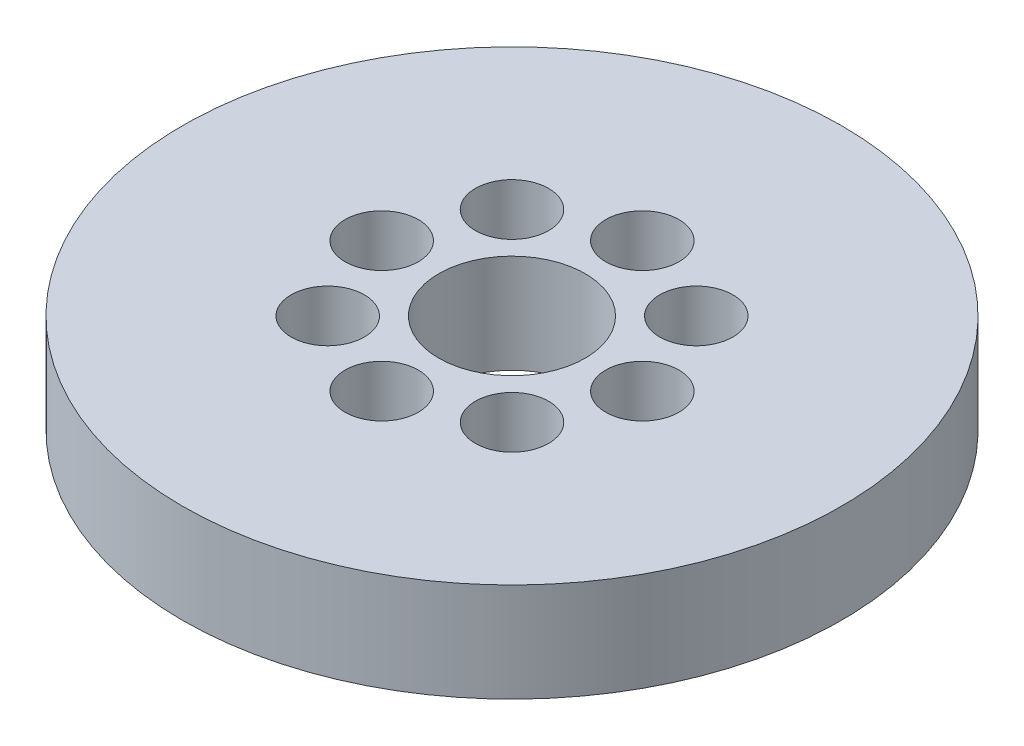
ISO-10303-21;
HEADER;
FILE_DESCRIPTION(('STEP AP214'),'2;1');
FILE_NAME('part.step','',(''),(''),'','','');
FILE_SCHEMA(('AUTOMOTIVE_DESIGN { 1 0 10303 214 1 1 1 1 }'));
ENDSEC;
DATA;
#1=APPLICATION_CONTEXT('core data for automotive mechanical design processes');
#2=APPLICATION_PROTOCOL_DEFINITION('international standard','automotive_design',2000,#1);
#3=PRODUCT_CONTEXT('',#1,'mechanical');
#4=PRODUCT('Part','Part','',(#3));
#5=PRODUCT_RELATED_PRODUCT_CATEGORY('part','',(#4));
#6=PRODUCT_DEFINITION_FORMATION('','',#4);
#7=PRODUCT_DEFINITION_CONTEXT('part definition',#1,'design');
#8=PRODUCT_DEFINITION('design','',#6,#7);
#9=PRODUCT_DEFINITION_SHAPE('','',#8);
#10=(LENGTH_UNIT() NAMED_UNIT(*) SI_UNIT(.MILLI.,.METRE.));
#11=(NAMED_UNIT(*) PLANE_ANGLE_UNIT() SI_UNIT($,.RADIAN.));
#12=(NAMED_UNIT(*) SI_UNIT($,.STERADIAN.) SOLID_ANGLE_UNIT());
#13=UNCERTAINTY_MEASURE_WITH_UNIT(LENGTH_MEASURE(1.E-05),#10,'distance_accuracy_value','');
#14=(GEOMETRIC_REPRESENTATION_CONTEXT(3) GLOBAL_UNCERTAINTY_ASSIGNED_CONTEXT((#13)) GLOBAL_UNIT_ASSIGNED_CONTEXT((#10,
#11,#12)) REPRESENTATION_CONTEXT('',''));
#15=CARTESIAN_POINT('',(0.,0.,0.));
#16=DIRECTION('',(0.,0.,1.));
#17=DIRECTION('',(1.,0.,0.));
#18=AXIS2_PLACEMENT_3D('',#15,#16,#17);
#19=CARTESIAN_POINT('',(0.,27.,0.));
#20=DIRECTION('',(0.,-1.,0.));
#21=DIRECTION('',(0.,0.,-1.));
#22=AXIS2_PLACEMENT_3D('',#19,#20,#21);
#23=CYLINDRICAL_SURFACE('',#22,90.);
#24=CARTESIAN_POINT('',(0.,27.,0.));
#25=DIRECTION('',(0.,1.,0.));
#26=DIRECTION('',(0.,0.,1.));
#27=AXIS2_PLACEMENT_3D('',#24,#25,#26);
#28=CIRCLE('',#27,90.);
#29=CARTESIAN_POINT('',(0.,27.,90.));
#30=VERTEX_POINT('',#29);
#31=EDGE_CURVE('E10',#30,#30,#28,.T.);
#32=ORIENTED_EDGE('',*,*,#31,.F.);
#33=EDGE_LOOP('',(#32));
#34=FACE_BOUND('',#33,.T.);
#35=CARTESIAN_POINT('',(0.,0.,0.));
#36=DIRECTION('',(0.,1.,0.));
#37=DIRECTION('',(0.,0.,1.));
#38=AXIS2_PLACEMENT_3D('',#35,#36,#37);
#39=CIRCLE('',#38,90.);
#40=CARTESIAN_POINT('',(0.,0.,90.));
#41=VERTEX_POINT('',#40);
#42=EDGE_CURVE('E37',#41,#41,#39,.T.);
#43=ORIENTED_EDGE('',*,*,#42,.T.);
#44=EDGE_LOOP('',(#43));
#45=FACE_BOUND('',#44,.T.);
#46=ADVANCED_FACE('F40',(#34,#45),#23,.T.);
#47=CARTESIAN_POINT('',(0.,27.,0.));
#48=DIRECTION('',(0.,1.,0.));
#49=DIRECTION('',(0.,0.,1.));
#50=AXIS2_PLACEMENT_3D('',#47,#48,#49);
#51=PLANE('',#50);
#52=CARTESIAN_POINT('',(1.2425375877729E-13,27.,35.5876909307669));
#53=DIRECTION('',(0.,1.,0.));
#54=DIRECTION('',(1.,0.,0.));
#55=AXIS2_PLACEMENT_3D('',#52,#53,#54);
#56=CIRCLE('',#55,10.);
#57=CARTESIAN_POINT('',(10.0000000000001,27.,35.5876909307669));
#58=VERTEX_POINT('',#57);
#59=EDGE_CURVE('E88',#58,#58,#56,.T.);
#60=ORIENTED_EDGE('',*,*,#59,.F.);
#61=EDGE_LOOP('',(#60));
#62=FACE_BOUND('',#61,.T.);
#63=CARTESIAN_POINT('',(25.1642975839164,27.,25.1642975839161));
#64=DIRECTION('',(0.,1.,0.));
#65=DIRECTION('',(0.707106781186544,0.,-0.707106781186551));
#66=AXIS2_PLACEMENT_3D('',#63,#64,#65);
#67=CIRCLE('',#66,10.);
#68=CARTESIAN_POINT('',(32.2353653957818,27.,18.0932297720506));
#69=VERTEX_POINT('',#68);
#70=EDGE_CURVE('E79',#69,#69,#67,.T.);
#71=ORIENTED_EDGE('',*,*,#70,.F.);
#72=EDGE_LOOP('',(#71));
#73=FACE_BOUND('',#72,.T.);
#74=CARTESIAN_POINT('',(35.5876909307669,27.,0.));
#75=DIRECTION('',(0.,1.,0.));
#76=DIRECTION('',(0.,0.,-1.));
#77=AXIS2_PLACEMENT_3D('',#74,#75,#76);
#78=CIRCLE('',#77,10.);
#79=CARTESIAN_POINT('',(35.5876909307669,27.,-10.));
#80=VERTEX_POINT('',#79);
#81=EDGE_CURVE('E74',#80,#80,#78,.T.);
#82=ORIENTED_EDGE('',*,*,#81,.F.);
#83=EDGE_LOOP('',(#82));
#84=FACE_BOUND('',#83,.T.);
#85=CARTESIAN_POINT('',(25.1642975839161,27.,-25.1642975839165));
#86=DIRECTION('',(0.,1.,0.));
#87=DIRECTION('',(-0.707106781186554,0.,-0.707106781186541));
#88=AXIS2_PLACEMENT_3D('',#85,#86,#87);
#89=CIRCLE('',#88,10.);
#90=CARTESIAN_POINT('',(18.0932297720505,27.,-32.2353653957819));
#91=VERTEX_POINT('',#90);
#92=EDGE_CURVE('E70',#91,#91,#89,.T.);
#93=ORIENTED_EDGE('',*,*,#92,.F.);
#94=EDGE_LOOP('',(#93));
#95=FACE_BOUND('',#94,.T.);
#96=CARTESIAN_POINT('',(-3.72761276331869E-13,27.,-35.5876909307669));
#97=DIRECTION('',(0.,1.,0.));
#98=DIRECTION('',(-1.,0.,0.));
#99=AXIS2_PLACEMENT_3D('',#96,#97,#98);
#100=CIRCLE('',#99,10.);
#101=CARTESIAN_POINT('',(-10.0000000000004,27.,-35.5876909307668));
#102=VERTEX_POINT('',#101);
#103=EDGE_CURVE('E100',#102,#102,#100,.T.);
#104=ORIENTED_EDGE('',*,*,#103,.F.);
#105=EDGE_LOOP('',(#104));
#106=FACE_BOUND('',#105,.T.);
#107=CARTESIAN_POINT('',(-25.1642975839166,27.,-25.164297583916));
#108=DIRECTION('',(0.,1.,0.));
#109=DIRECTION('',(-0.707106781186539,0.,0.707106781186556));
#110=AXIS2_PLACEMENT_3D('',#107,#108,#109);
#111=CIRCLE('',#110,10.);
#112=CARTESIAN_POINT('',(-32.235365395782,27.,-18.0932297720504));
#113=VERTEX_POINT('',#112);
#114=EDGE_CURVE('E93',#113,#113,#111,.T.);
#115=ORIENTED_EDGE('',*,*,#114,.F.);
#116=EDGE_LOOP('',(#115));
#117=FACE_BOUND('',#116,.T.);
#118=CARTESIAN_POINT('',(-25.1642975839162,27.,25.1642975839163));
#119=DIRECTION('',(0.,1.,0.));
#120=DIRECTION('',(0.707106781186549,0.,0.707106781186546));
#121=AXIS2_PLACEMENT_3D('',#118,#119,#120);
#122=CIRCLE('',#121,10.);
#123=CARTESIAN_POINT('',(-18.0932297720507,27.,32.2353653957818));
#124=VERTEX_POINT('',#123);
#125=EDGE_CURVE('E61',#124,#124,#122,.T.);
#126=ORIENTED_EDGE('',*,*,#125,.F.);
#127=EDGE_LOOP('',(#126));
#128=FACE_BOUND('',#127,.T.);
#129=CARTESIAN_POINT('',(-35.5876909307669,27.,0.));
#130=DIRECTION('',(0.,1.,0.));
#131=DIRECTION('',(0.,0.,1.));
#132=AXIS2_PLACEMENT_3D('',#129,#130,#131);
#133=CIRCLE('',#132,10.);
#134=CARTESIAN_POINT('',(-35.5876909307669,27.,10.));
#135=VERTEX_POINT('',#134);
#136=EDGE_CURVE('E54',#135,#135,#133,.T.);
#137=ORIENTED_EDGE('',*,*,#136,.F.);
#138=EDGE_LOOP('',(#137));
#139=FACE_BOUND('',#138,.T.);
#140=CARTESIAN_POINT('',(0.,27.,0.));
#141=DIRECTION('',(0.,1.,0.));
#142=DIRECTION('',(0.,0.,1.));
#143=AXIS2_PLACEMENT_3D('',#140,#141,#142);
#144=CIRCLE('',#143,20.);
#145=CARTESIAN_POINT('',(0.,27.,20.));
#146=VERTEX_POINT('',#145);
#147=EDGE_CURVE('E50',#146,#146,#144,.T.);
#148=ORIENTED_EDGE('',*,*,#147,.F.);
#149=EDGE_LOOP('',(#148));
#150=FACE_BOUND('',#149,.T.);
#151=ORIENTED_EDGE('',*,*,#31,.T.);
#152=EDGE_LOOP('',(#151));
#153=FACE_BOUND('',#152,.T.);
#154=ADVANCED_FACE('F115',(#62,#73,#84,#95,#106,#117,#128,#139,#150,#153),#51,.T.);
#155=CARTESIAN_POINT('',(0.,0.,0.));
#156=DIRECTION('',(0.,1.,0.));
#157=DIRECTION('',(0.,0.,1.));
#158=AXIS2_PLACEMENT_3D('',#155,#156,#157);
#159=PLANE('',#158);
#160=CARTESIAN_POINT('',(0.,0.,0.));
#161=DIRECTION('',(0.,1.,0.));
#162=DIRECTION('',(0.,0.,1.));
#163=AXIS2_PLACEMENT_3D('',#160,#161,#162);
#164=CIRCLE('',#163,20.);
#165=CARTESIAN_POINT('',(0.,0.,20.));
#166=VERTEX_POINT('',#165);
#167=EDGE_CURVE('E47',#166,#166,#164,.T.);
#168=ORIENTED_EDGE('',*,*,#167,.T.);
#169=EDGE_LOOP('',(#168));
#170=FACE_BOUND('',#169,.T.);
#171=ORIENTED_EDGE('',*,*,#42,.F.);
#172=EDGE_LOOP('',(#171));
#173=FACE_BOUND('',#172,.T.);
#174=ADVANCED_FACE('F113',(#170,#173),#159,.F.);
#175=CARTESIAN_POINT('',(0.,27.,0.));
#176=DIRECTION('',(0.,-1.,0.));
#177=DIRECTION('',(0.,0.,-1.));
#178=AXIS2_PLACEMENT_3D('',#175,#176,#177);
#179=CYLINDRICAL_SURFACE('',#178,20.);
#180=ORIENTED_EDGE('',*,*,#147,.T.);
#181=EDGE_LOOP('',(#180));
#182=FACE_BOUND('',#181,.T.);
#183=ORIENTED_EDGE('',*,*,#167,.F.);
#184=EDGE_LOOP('',(#183));
#185=FACE_BOUND('',#184,.T.);
#186=ADVANCED_FACE('F127',(#182,#185),#179,.F.);
#187=CARTESIAN_POINT('',(-35.5876909307669,6.73794938277837,0.));
#188=DIRECTION('',(0.,1.,0.));
#189=DIRECTION('',(0.,0.,1.));
#190=AXIS2_PLACEMENT_3D('',#187,#188,#189);
#191=CYLINDRICAL_SURFACE('',#190,10.);
#192=CARTESIAN_POINT('',(-35.5876909307669,6.73794938277837,0.));
#193=DIRECTION('',(0.,1.,0.));
#194=DIRECTION('',(0.,0.,1.));
#195=AXIS2_PLACEMENT_3D('',#192,#193,#194);
#196=CIRCLE('',#195,10.);
#197=CARTESIAN_POINT('',(-35.5876909307669,6.73794938277837,10.));
#198=VERTEX_POINT('',#197);
#199=EDGE_CURVE('E55',#198,#198,#196,.T.);
#200=ORIENTED_EDGE('',*,*,#199,.F.);
#201=EDGE_LOOP('',(#200));
#202=FACE_BOUND('',#201,.T.);
#203=ORIENTED_EDGE('',*,*,#136,.T.);
#204=EDGE_LOOP('',(#203));
#205=FACE_BOUND('',#204,.T.);
#206=ADVANCED_FACE('F129',(#202,#205),#191,.F.);
#207=CARTESIAN_POINT('',(-35.5876909307669,6.73794938277837,0.));
#208=DIRECTION('',(0.,1.,0.));
#209=DIRECTION('',(0.,0.,1.));
#210=AXIS2_PLACEMENT_3D('',#207,#208,#209);
#211=PLANE('',#210);
#212=ORIENTED_EDGE('',*,*,#199,.T.);
#213=EDGE_LOOP('',(#212));
#214=FACE_BOUND('',#213,.T.);
#215=ADVANCED_FACE('F157',(#214),#211,.T.);
#216=CARTESIAN_POINT('',(-25.1642975839162,6.73794938277837,25.1642975839163));
#217=DIRECTION('',(0.,1.,0.));
#218=DIRECTION('',(0.,0.,1.));
#219=AXIS2_PLACEMENT_3D('',#216,#217,#218);
#220=CYLINDRICAL_SURFACE('',#219,10.);
#221=CARTESIAN_POINT('',(-25.1642975839162,6.73794938277837,25.1642975839163));
#222=DIRECTION('',(0.,1.,0.));
#223=DIRECTION('',(0.707106781186549,0.,0.707106781186546));
#224=AXIS2_PLACEMENT_3D('',#221,#222,#223);
#225=CIRCLE('',#224,10.);
#226=CARTESIAN_POINT('',(-18.0932297720507,6.73794938277837,32.2353653957818));
#227=VERTEX_POINT('',#226);
#228=EDGE_CURVE('E59',#227,#227,#225,.T.);
#229=ORIENTED_EDGE('',*,*,#228,.F.);
#230=EDGE_LOOP('',(#229));
#231=FACE_BOUND('',#230,.T.);
#232=ORIENTED_EDGE('',*,*,#125,.T.);
#233=EDGE_LOOP('',(#232));
#234=FACE_BOUND('',#233,.T.);
#235=ADVANCED_FACE('F170',(#231,#234),#220,.F.);
#236=CARTESIAN_POINT('',(-25.1642975839162,6.73794938277837,25.1642975839163));
#237=DIRECTION('',(0.,1.,0.));
#238=DIRECTION('',(0.707106781186549,0.,0.707106781186546));
#239=AXIS2_PLACEMENT_3D('',#236,#237,#238);
#240=PLANE('',#239);
#241=ORIENTED_EDGE('',*,*,#228,.T.);
#242=EDGE_LOOP('',(#241));
#243=FACE_BOUND('',#242,.T.);
#244=ADVANCED_FACE('F182',(#243),#240,.T.);
#245=CARTESIAN_POINT('',(-25.1642975839166,6.73794938277837,-25.164297583916));
#246=DIRECTION('',(0.,1.,0.));
#247=DIRECTION('',(0.,0.,1.));
#248=AXIS2_PLACEMENT_3D('',#245,#246,#247);
#249=CYLINDRICAL_SURFACE('',#248,10.);
#250=CARTESIAN_POINT('',(-25.1642975839166,6.73794938277837,-25.164297583916));
#251=DIRECTION('',(0.,1.,0.));
#252=DIRECTION('',(-0.707106781186539,0.,0.707106781186556));
#253=AXIS2_PLACEMENT_3D('',#250,#251,#252);
#254=CIRCLE('',#253,10.);
#255=CARTESIAN_POINT('',(-32.235365395782,6.73794938277837,-18.0932297720504));
#256=VERTEX_POINT('',#255);
#257=EDGE_CURVE('E94',#256,#256,#254,.T.);
#258=ORIENTED_EDGE('',*,*,#257,.F.);
#259=EDGE_LOOP('',(#258));
#260=FACE_BOUND('',#259,.T.);
#261=ORIENTED_EDGE('',*,*,#114,.T.);
#262=EDGE_LOOP('',(#261));
#263=FACE_BOUND('',#262,.T.);
#264=ADVANCED_FACE('F189',(#260,#263),#249,.F.);
#265=CARTESIAN_POINT('',(-25.1642975839166,6.73794938277837,-25.164297583916));
#266=DIRECTION('',(0.,1.,0.));
#267=DIRECTION('',(-0.707106781186539,0.,0.707106781186556));
#268=AXIS2_PLACEMENT_3D('',#265,#266,#267);
#269=PLANE('',#268);
#270=ORIENTED_EDGE('',*,*,#257,.T.);
#271=EDGE_LOOP('',(#270));
#272=FACE_BOUND('',#271,.T.);
#273=ADVANCED_FACE('F107',(#272),#269,.T.);
#274=CARTESIAN_POINT('',(-3.72761276331869E-13,6.73794938277837,-35.5876909307669));
#275=DIRECTION('',(0.,1.,0.));
#276=DIRECTION('',(0.,0.,1.));
#277=AXIS2_PLACEMENT_3D('',#274,#275,#276);
#278=CYLINDRICAL_SURFACE('',#277,10.);
#279=CARTESIAN_POINT('',(-3.72761276331869E-13,6.73794938277837,-35.5876909307669));
#280=DIRECTION('',(0.,1.,0.));
#281=DIRECTION('',(-1.,0.,0.));
#282=AXIS2_PLACEMENT_3D('',#279,#280,#281);
#283=CIRCLE('',#282,10.);
#284=CARTESIAN_POINT('',(-10.0000000000004,6.73794938277837,-35.5876909307668));
#285=VERTEX_POINT('',#284);
#286=EDGE_CURVE('E72',#285,#285,#283,.T.);
#287=ORIENTED_EDGE('',*,*,#286,.F.);
#288=EDGE_LOOP('',(#287));
#289=FACE_BOUND('',#288,.T.);
#290=ORIENTED_EDGE('',*,*,#103,.T.);
#291=EDGE_LOOP('',(#290));
#292=FACE_BOUND('',#291,.T.);
#293=ADVANCED_FACE('F104',(#289,#292),#278,.F.);
#294=CARTESIAN_POINT('',(-3.72761276331869E-13,6.73794938277837,-35.5876909307669));
#295=DIRECTION('',(0.,1.,0.));
#296=DIRECTION('',(-1.,0.,0.));
#297=AXIS2_PLACEMENT_3D('',#294,#295,#296);
#298=PLANE('',#297);
#299=ORIENTED_EDGE('',*,*,#286,.T.);
#300=EDGE_LOOP('',(#299));
#301=FACE_BOUND('',#300,.T.);
#302=ADVANCED_FACE('F103',(#301),#298,.T.);
#303=CARTESIAN_POINT('',(25.1642975839161,6.73794938277837,-25.1642975839165));
#304=DIRECTION('',(0.,1.,0.));
#305=DIRECTION('',(0.,0.,1.));
#306=AXIS2_PLACEMENT_3D('',#303,#304,#305);
#307=CYLINDRICAL_SURFACE('',#306,10.);
#308=CARTESIAN_POINT('',(25.1642975839161,6.73794938277837,-25.1642975839165));
#309=DIRECTION('',(0.,1.,0.));
#310=DIRECTION('',(-0.707106781186554,0.,-0.707106781186541));
#311=AXIS2_PLACEMENT_3D('',#308,#309,#310);
#312=CIRCLE('',#311,10.);
#313=CARTESIAN_POINT('',(18.0932297720505,6.73794938277837,-32.2353653957819));
#314=VERTEX_POINT('',#313);
#315=EDGE_CURVE('E69',#314,#314,#312,.T.);
#316=ORIENTED_EDGE('',*,*,#315,.F.);
#317=EDGE_LOOP('',(#316));
#318=FACE_BOUND('',#317,.T.);
#319=ORIENTED_EDGE('',*,*,#92,.T.);
#320=EDGE_LOOP('',(#319));
#321=FACE_BOUND('',#320,.T.);
#322=ADVANCED_FACE('F219',(#318,#321),#307,.F.);
#323=CARTESIAN_POINT('',(25.1642975839161,6.73794938277837,-25.1642975839165));
#324=DIRECTION('',(0.,1.,0.));
#325=DIRECTION('',(-0.707106781186554,0.,-0.707106781186541));
#326=AXIS2_PLACEMENT_3D('',#323,#324,#325);
#327=PLANE('',#326);
#328=ORIENTED_EDGE('',*,*,#315,.T.);
#329=EDGE_LOOP('',(#328));
#330=FACE_BOUND('',#329,.T.);
#331=ADVANCED_FACE('F227',(#330),#327,.T.);
#332=CARTESIAN_POINT('',(35.5876909307669,6.73794938277837,0.));
#333=DIRECTION('',(0.,1.,0.));
#334=DIRECTION('',(0.,0.,1.));
#335=AXIS2_PLACEMENT_3D('',#332,#333,#334);
#336=CYLINDRICAL_SURFACE('',#335,10.);
#337=CARTESIAN_POINT('',(35.5876909307669,6.73794938277837,0.));
#338=DIRECTION('',(0.,1.,0.));
#339=DIRECTION('',(0.,0.,-1.));
#340=AXIS2_PLACEMENT_3D('',#337,#338,#339);
#341=CIRCLE('',#340,10.);
#342=CARTESIAN_POINT('',(35.5876909307669,6.73794938277837,-10.));
#343=VERTEX_POINT('',#342);
#344=EDGE_CURVE('E80',#343,#343,#341,.T.);
#345=ORIENTED_EDGE('',*,*,#344,.F.);
#346=EDGE_LOOP('',(#345));
#347=FACE_BOUND('',#346,.T.);
#348=ORIENTED_EDGE('',*,*,#81,.T.);
#349=EDGE_LOOP('',(#348));
#350=FACE_BOUND('',#349,.T.);
#351=ADVANCED_FACE('F240',(#347,#350),#336,.F.);
#352=CARTESIAN_POINT('',(35.5876909307669,6.73794938277837,0.));
#353=DIRECTION('',(0.,1.,0.));
#354=DIRECTION('',(0.,0.,-1.));
#355=AXIS2_PLACEMENT_3D('',#352,#353,#354);
#356=PLANE('',#355);
#357=ORIENTED_EDGE('',*,*,#344,.T.);
#358=EDGE_LOOP('',(#357));
#359=FACE_BOUND('',#358,.T.);
#360=ADVANCED_FACE('F246',(#359),#356,.T.);
#361=CARTESIAN_POINT('',(25.1642975839164,6.73794938277837,25.1642975839161));
#362=DIRECTION('',(0.,1.,0.));
#363=DIRECTION('',(0.,0.,1.));
#364=AXIS2_PLACEMENT_3D('',#361,#362,#363);
#365=CYLINDRICAL_SURFACE('',#364,10.);
#366=CARTESIAN_POINT('',(25.1642975839164,6.73794938277837,25.1642975839161));
#367=DIRECTION('',(0.,1.,0.));
#368=DIRECTION('',(0.707106781186544,0.,-0.707106781186551));
#369=AXIS2_PLACEMENT_3D('',#366,#367,#368);
#370=CIRCLE('',#369,10.);
#371=CARTESIAN_POINT('',(32.2353653957818,6.73794938277837,18.0932297720506));
#372=VERTEX_POINT('',#371);
#373=EDGE_CURVE('E82',#372,#372,#370,.T.);
#374=ORIENTED_EDGE('',*,*,#373,.F.);
#375=EDGE_LOOP('',(#374));
#376=FACE_BOUND('',#375,.T.);
#377=ORIENTED_EDGE('',*,*,#70,.T.);
#378=EDGE_LOOP('',(#377));
#379=FACE_BOUND('',#378,.T.);
#380=ADVANCED_FACE('F254',(#376,#379),#365,.F.);
#381=CARTESIAN_POINT('',(25.1642975839164,6.73794938277837,25.1642975839161));
#382=DIRECTION('',(0.,1.,0.));
#383=DIRECTION('',(0.707106781186544,0.,-0.707106781186551));
#384=AXIS2_PLACEMENT_3D('',#381,#382,#383);
#385=PLANE('',#384);
#386=ORIENTED_EDGE('',*,*,#373,.T.);
#387=EDGE_LOOP('',(#386));
#388=FACE_BOUND('',#387,.T.);
#389=ADVANCED_FACE('F262',(#388),#385,.T.);
#390=CARTESIAN_POINT('',(1.2425375877729E-13,6.73794938277837,35.5876909307669));
#391=DIRECTION('',(0.,1.,0.));
#392=DIRECTION('',(0.,0.,1.));
#393=AXIS2_PLACEMENT_3D('',#390,#391,#392);
#394=CYLINDRICAL_SURFACE('',#393,10.);
#395=CARTESIAN_POINT('',(1.2425375877729E-13,6.73794938277837,35.5876909307669));
#396=DIRECTION('',(0.,1.,0.));
#397=DIRECTION('',(1.,0.,0.));
#398=AXIS2_PLACEMENT_3D('',#395,#396,#397);
#399=CIRCLE('',#398,10.);
#400=CARTESIAN_POINT('',(10.0000000000001,6.73794938277837,35.5876909307669));
#401=VERTEX_POINT('',#400);
#402=EDGE_CURVE('E63',#401,#401,#399,.T.);
#403=ORIENTED_EDGE('',*,*,#402,.F.);
#404=EDGE_LOOP('',(#403));
#405=FACE_BOUND('',#404,.T.);
#406=ORIENTED_EDGE('',*,*,#59,.T.);
#407=EDGE_LOOP('',(#406));
#408=FACE_BOUND('',#407,.T.);
#409=ADVANCED_FACE('F272',(#405,#408),#394,.F.);
#410=CARTESIAN_POINT('',(1.2425375877729E-13,6.73794938277837,35.5876909307669));
#411=DIRECTION('',(0.,1.,0.));
#412=DIRECTION('',(1.,0.,0.));
#413=AXIS2_PLACEMENT_3D('',#410,#411,#412);
#414=PLANE('',#413);
#415=ORIENTED_EDGE('',*,*,#402,.T.);
#416=EDGE_LOOP('',(#415));
#417=FACE_BOUND('',#416,.T.);
#418=ADVANCED_FACE('F285',(#417),#414,.T.);
#419=CLOSED_SHELL('',(#46,#154,#174,#186,#206,#215,#235,#244,#264,#273,#293,#302,#322,#331,#351,
#360,#380,#389,#409,#418));
#420=MANIFOLD_SOLID_BREP('B2',#419);
#421=ADVANCED_BREP_SHAPE_REPRESENTATION('',(#18,#420),#14);
#422=SHAPE_DEFINITION_REPRESENTATION(#9,#421);
ENDSEC;
END-ISO-10303-21;
